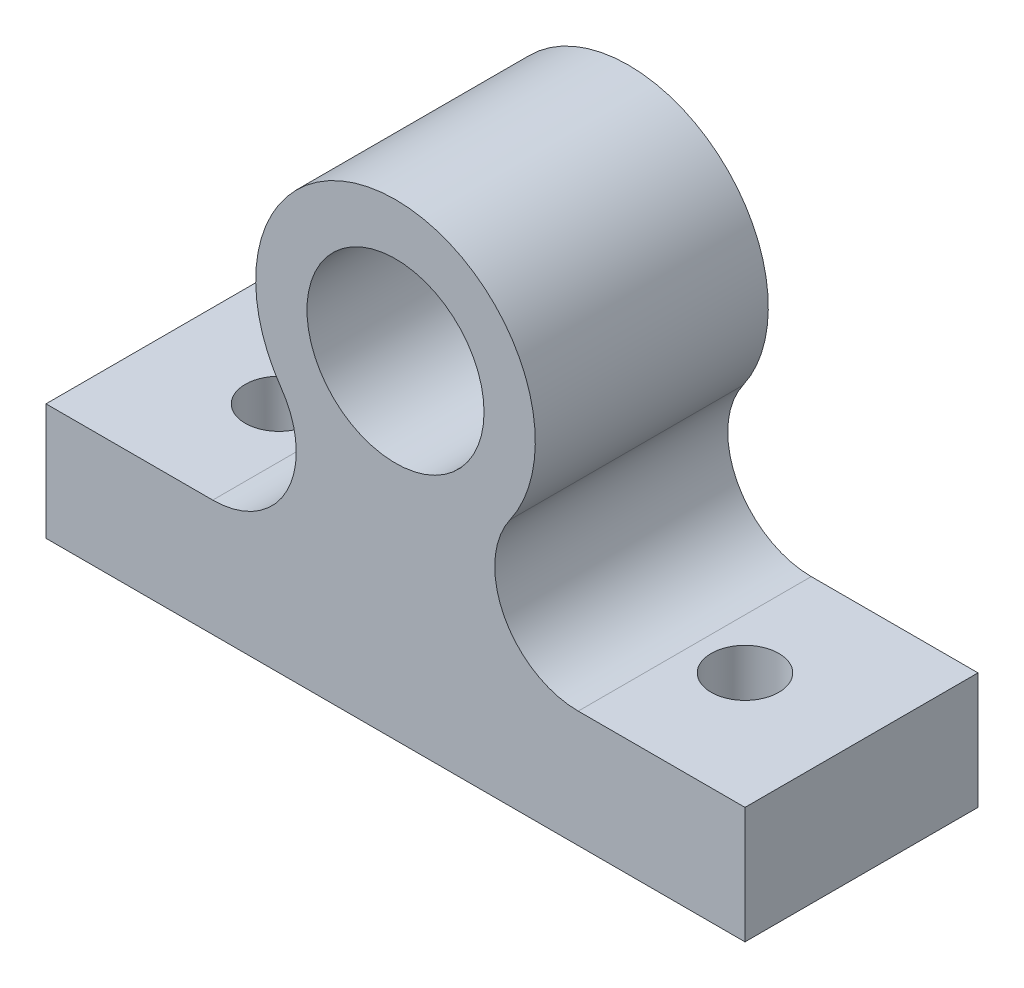
ISO-10303-21;
HEADER;
FILE_DESCRIPTION(('STEP AP214'),'2;1');
FILE_NAME('part.step','',(''),(''),'','','');
FILE_SCHEMA(('AUTOMOTIVE_DESIGN { 1 0 10303 214 1 1 1 1 }'));
ENDSEC;
DATA;
#1=APPLICATION_CONTEXT('core data for automotive mechanical design processes');
#2=APPLICATION_PROTOCOL_DEFINITION('international standard','automotive_design',2000,#1);
#3=PRODUCT_CONTEXT('',#1,'mechanical');
#4=PRODUCT('Part','Part','',(#3));
#5=PRODUCT_RELATED_PRODUCT_CATEGORY('part','',(#4));
#6=PRODUCT_DEFINITION_FORMATION('','',#4);
#7=PRODUCT_DEFINITION_CONTEXT('part definition',#1,'design');
#8=PRODUCT_DEFINITION('design','',#6,#7);
#9=PRODUCT_DEFINITION_SHAPE('','',#8);
#10=(LENGTH_UNIT() NAMED_UNIT(*) SI_UNIT(.MILLI.,.METRE.));
#11=(NAMED_UNIT(*) PLANE_ANGLE_UNIT() SI_UNIT($,.RADIAN.));
#12=(NAMED_UNIT(*) SI_UNIT($,.STERADIAN.) SOLID_ANGLE_UNIT());
#13=UNCERTAINTY_MEASURE_WITH_UNIT(LENGTH_MEASURE(1.E-05),#10,'distance_accuracy_value','');
#14=(GEOMETRIC_REPRESENTATION_CONTEXT(3) GLOBAL_UNCERTAINTY_ASSIGNED_CONTEXT((#13)) GLOBAL_UNIT_ASSIGNED_CONTEXT((#10,
#11,#12)) REPRESENTATION_CONTEXT('',''));
#15=CARTESIAN_POINT('',(0.,0.,0.));
#16=DIRECTION('',(0.,0.,1.));
#17=DIRECTION('',(1.,0.,0.));
#18=AXIS2_PLACEMENT_3D('',#15,#16,#17);
#19=CARTESIAN_POINT('',(9.08916554618517,10.9012996441002,12.7));
#20=DIRECTION('',(0.,0.,1.));
#21=DIRECTION('',(1.,0.,0.));
#22=AXIS2_PLACEMENT_3D('',#19,#20,#21);
#23=PLANE('',#22);
#24=DIRECTION('',(0.,-1.,0.));
#25=VECTOR('',#24,1.);
#26=CARTESIAN_POINT('',(0.,0.,12.7));
#27=LINE('',#26,#25);
#28=CARTESIAN_POINT('',(0.,6.35,12.7));
#29=VERTEX_POINT('',#28);
#30=CARTESIAN_POINT('',(0.,0.,12.7));
#31=VERTEX_POINT('',#30);
#32=EDGE_CURVE('E170',#29,#31,#27,.T.);
#33=ORIENTED_EDGE('',*,*,#32,.T.);
#34=DIRECTION('',(1.,0.,0.));
#35=VECTOR('',#34,1.);
#36=CARTESIAN_POINT('',(0.,0.,12.7));
#37=LINE('',#36,#35);
#38=CARTESIAN_POINT('',(38.1,0.,12.7));
#39=VERTEX_POINT('',#38);
#40=EDGE_CURVE('E106',#31,#39,#37,.T.);
#41=ORIENTED_EDGE('',*,*,#40,.T.);
#42=DIRECTION('',(0.,1.,0.));
#43=VECTOR('',#42,1.);
#44=CARTESIAN_POINT('',(38.1,0.,12.7));
#45=LINE('',#44,#43);
#46=CARTESIAN_POINT('',(38.1,6.35,12.7));
#47=VERTEX_POINT('',#46);
#48=EDGE_CURVE('E216',#39,#47,#45,.T.);
#49=ORIENTED_EDGE('',*,*,#48,.T.);
#50=DIRECTION('',(-1.,0.,0.));
#51=VECTOR('',#50,1.);
#52=CARTESIAN_POINT('',(38.1,6.35,12.7));
#53=LINE('',#52,#51);
#54=CARTESIAN_POINT('',(29.0108344538148,6.35,12.7));
#55=VERTEX_POINT('',#54);
#56=EDGE_CURVE('E219',#47,#55,#53,.T.);
#57=ORIENTED_EDGE('',*,*,#56,.T.);
#58=CARTESIAN_POINT('',(29.0108344538148,10.9012996441002,12.7));
#59=DIRECTION('',(0.,0.,-1.));
#60=DIRECTION('',(-1.,0.,0.));
#61=AXIS2_PLACEMENT_3D('',#58,#59,#60);
#62=CIRCLE('',#61,4.55129964410019);
#63=CARTESIAN_POINT('',(25.2861095986048,13.5167830035134,12.7));
#64=VERTEX_POINT('',#63);
#65=EDGE_CURVE('E125',#55,#64,#62,.T.);
#66=ORIENTED_EDGE('',*,*,#65,.T.);
#67=CARTESIAN_POINT('',(19.05,17.8957483007256,12.7));
#68=DIRECTION('',(0.,0.,1.));
#69=DIRECTION('',(1.,0.,0.));
#70=AXIS2_PLACEMENT_3D('',#67,#68,#69);
#71=CIRCLE('',#70,7.62);
#72=CARTESIAN_POINT('',(12.8138904013952,13.5167830035134,12.7));
#73=VERTEX_POINT('',#72);
#74=EDGE_CURVE('E119',#64,#73,#71,.T.);
#75=ORIENTED_EDGE('',*,*,#74,.T.);
#76=CARTESIAN_POINT('',(9.08916554618517,10.9012996441002,12.7));
#77=DIRECTION('',(0.,0.,-1.));
#78=DIRECTION('',(1.,0.,0.));
#79=AXIS2_PLACEMENT_3D('',#76,#77,#78);
#80=CIRCLE('',#79,4.5512996441002);
#81=CARTESIAN_POINT('',(9.08916554618517,6.35,12.7));
#82=VERTEX_POINT('',#81);
#83=EDGE_CURVE('E123',#73,#82,#80,.T.);
#84=ORIENTED_EDGE('',*,*,#83,.T.);
#85=DIRECTION('',(-1.,0.,0.));
#86=VECTOR('',#85,1.);
#87=CARTESIAN_POINT('',(0.,6.35,12.7));
#88=LINE('',#87,#86);
#89=EDGE_CURVE('E63',#82,#29,#88,.T.);
#90=ORIENTED_EDGE('',*,*,#89,.T.);
#91=EDGE_LOOP('',(#33,#41,#49,#57,#66,#75,#84,#90));
#92=FACE_BOUND('',#91,.T.);
#93=CARTESIAN_POINT('',(19.05,17.8957483007256,12.7));
#94=DIRECTION('',(0.,0.,1.));
#95=DIRECTION('',(1.,0.,0.));
#96=AXIS2_PLACEMENT_3D('',#93,#94,#95);
#97=CIRCLE('',#96,4.826);
#98=CARTESIAN_POINT('',(23.876,17.8957483007256,12.7));
#99=VERTEX_POINT('',#98);
#100=EDGE_CURVE('E152',#99,#99,#97,.T.);
#101=ORIENTED_EDGE('',*,*,#100,.F.);
#102=EDGE_LOOP('',(#101));
#103=FACE_BOUND('',#102,.T.);
#104=ADVANCED_FACE('F43',(#92,#103),#23,.T.);
#105=CARTESIAN_POINT('',(9.08916554618517,10.9012996441002,0.));
#106=DIRECTION('',(0.,0.,1.));
#107=DIRECTION('',(1.,0.,0.));
#108=AXIS2_PLACEMENT_3D('',#105,#106,#107);
#109=PLANE('',#108);
#110=DIRECTION('',(0.,-1.,0.));
#111=VECTOR('',#110,1.);
#112=CARTESIAN_POINT('',(0.,0.,0.));
#113=LINE('',#112,#111);
#114=CARTESIAN_POINT('',(0.,6.35,0.));
#115=VERTEX_POINT('',#114);
#116=CARTESIAN_POINT('',(0.,0.,0.));
#117=VERTEX_POINT('',#116);
#118=EDGE_CURVE('E147',#115,#117,#113,.T.);
#119=ORIENTED_EDGE('',*,*,#118,.F.);
#120=DIRECTION('',(-1.,0.,0.));
#121=VECTOR('',#120,1.);
#122=CARTESIAN_POINT('',(0.,6.35,0.));
#123=LINE('',#122,#121);
#124=CARTESIAN_POINT('',(9.08916554618517,6.35,0.));
#125=VERTEX_POINT('',#124);
#126=EDGE_CURVE('E98',#125,#115,#123,.T.);
#127=ORIENTED_EDGE('',*,*,#126,.F.);
#128=CARTESIAN_POINT('',(9.08916554618517,10.9012996441002,0.));
#129=DIRECTION('',(0.,0.,-1.));
#130=DIRECTION('',(1.,0.,0.));
#131=AXIS2_PLACEMENT_3D('',#128,#129,#130);
#132=CIRCLE('',#131,4.5512996441002);
#133=CARTESIAN_POINT('',(12.8138904013952,13.5167830035134,0.));
#134=VERTEX_POINT('',#133);
#135=EDGE_CURVE('E92',#134,#125,#132,.T.);
#136=ORIENTED_EDGE('',*,*,#135,.F.);
#137=CARTESIAN_POINT('',(19.05,17.8957483007256,0.));
#138=DIRECTION('',(0.,0.,1.));
#139=DIRECTION('',(1.,0.,0.));
#140=AXIS2_PLACEMENT_3D('',#137,#138,#139);
#141=CIRCLE('',#140,7.62);
#142=CARTESIAN_POINT('',(25.2861095986048,13.5167830035134,0.));
#143=VERTEX_POINT('',#142);
#144=EDGE_CURVE('E134',#143,#134,#141,.T.);
#145=ORIENTED_EDGE('',*,*,#144,.F.);
#146=CARTESIAN_POINT('',(29.0108344538148,10.9012996441002,0.));
#147=DIRECTION('',(0.,0.,-1.));
#148=DIRECTION('',(-1.,0.,0.));
#149=AXIS2_PLACEMENT_3D('',#146,#147,#148);
#150=CIRCLE('',#149,4.55129964410019);
#151=CARTESIAN_POINT('',(29.0108344538148,6.35,0.));
#152=VERTEX_POINT('',#151);
#153=EDGE_CURVE('E161',#152,#143,#150,.T.);
#154=ORIENTED_EDGE('',*,*,#153,.F.);
#155=DIRECTION('',(-1.,0.,0.));
#156=VECTOR('',#155,1.);
#157=CARTESIAN_POINT('',(38.1,6.35,0.));
#158=LINE('',#157,#156);
#159=CARTESIAN_POINT('',(38.1,6.35,0.));
#160=VERTEX_POINT('',#159);
#161=EDGE_CURVE('E158',#160,#152,#158,.T.);
#162=ORIENTED_EDGE('',*,*,#161,.F.);
#163=DIRECTION('',(0.,1.,0.));
#164=VECTOR('',#163,1.);
#165=CARTESIAN_POINT('',(38.1,0.,0.));
#166=LINE('',#165,#164);
#167=CARTESIAN_POINT('',(38.1,0.,0.));
#168=VERTEX_POINT('',#167);
#169=EDGE_CURVE('E155',#168,#160,#166,.T.);
#170=ORIENTED_EDGE('',*,*,#169,.F.);
#171=DIRECTION('',(1.,0.,0.));
#172=VECTOR('',#171,1.);
#173=CARTESIAN_POINT('',(0.,0.,0.));
#174=LINE('',#173,#172);
#175=EDGE_CURVE('E151',#117,#168,#174,.T.);
#176=ORIENTED_EDGE('',*,*,#175,.F.);
#177=EDGE_LOOP('',(#119,#127,#136,#145,#154,#162,#170,#176));
#178=FACE_BOUND('',#177,.T.);
#179=CARTESIAN_POINT('',(19.05,17.8957483007256,0.));
#180=DIRECTION('',(0.,0.,1.));
#181=DIRECTION('',(1.,0.,0.));
#182=AXIS2_PLACEMENT_3D('',#179,#180,#181);
#183=CIRCLE('',#182,4.826);
#184=CARTESIAN_POINT('',(23.876,17.8957483007256,0.));
#185=VERTEX_POINT('',#184);
#186=EDGE_CURVE('E196',#185,#185,#183,.T.);
#187=ORIENTED_EDGE('',*,*,#186,.T.);
#188=EDGE_LOOP('',(#187));
#189=FACE_BOUND('',#188,.T.);
#190=ADVANCED_FACE('F234',(#178,#189),#109,.F.);
#191=CARTESIAN_POINT('',(0.,0.,12.7));
#192=DIRECTION('',(1.,0.,0.));
#193=DIRECTION('',(0.,0.,-1.));
#194=AXIS2_PLACEMENT_3D('',#191,#192,#193);
#195=PLANE('',#194);
#196=ORIENTED_EDGE('',*,*,#118,.T.);
#197=DIRECTION('',(0.,0.,-1.));
#198=VECTOR('',#197,1.);
#199=CARTESIAN_POINT('',(0.,0.,12.7));
#200=LINE('',#199,#198);
#201=EDGE_CURVE('E11',#31,#117,#200,.T.);
#202=ORIENTED_EDGE('',*,*,#201,.F.);
#203=ORIENTED_EDGE('',*,*,#32,.F.);
#204=DIRECTION('',(0.,0.,-1.));
#205=VECTOR('',#204,1.);
#206=CARTESIAN_POINT('',(0.,6.35,12.7));
#207=LINE('',#206,#205);
#208=EDGE_CURVE('E143',#29,#115,#207,.T.);
#209=ORIENTED_EDGE('',*,*,#208,.T.);
#210=EDGE_LOOP('',(#196,#202,#203,#209));
#211=FACE_BOUND('',#210,.T.);
#212=ADVANCED_FACE('F45',(#211),#195,.F.);
#213=CARTESIAN_POINT('',(0.,0.,12.7));
#214=DIRECTION('',(0.,1.,0.));
#215=DIRECTION('',(0.,0.,1.));
#216=AXIS2_PLACEMENT_3D('',#213,#214,#215);
#217=PLANE('',#216);
#218=CARTESIAN_POINT('',(6.35,0.,6.35));
#219=DIRECTION('',(0.,1.,0.));
#220=DIRECTION('',(0.,0.,1.));
#221=AXIS2_PLACEMENT_3D('',#218,#219,#220);
#222=CIRCLE('',#221,1.8415);
#223=CARTESIAN_POINT('',(6.35,0.,8.1915));
#224=VERTEX_POINT('',#223);
#225=EDGE_CURVE('E190',#224,#224,#222,.T.);
#226=ORIENTED_EDGE('',*,*,#225,.T.);
#227=EDGE_LOOP('',(#226));
#228=FACE_BOUND('',#227,.T.);
#229=CARTESIAN_POINT('',(31.75,0.,6.35));
#230=DIRECTION('',(0.,1.,0.));
#231=DIRECTION('',(0.,0.,1.));
#232=AXIS2_PLACEMENT_3D('',#229,#230,#231);
#233=CIRCLE('',#232,1.8415);
#234=CARTESIAN_POINT('',(31.75,0.,8.1915));
#235=VERTEX_POINT('',#234);
#236=EDGE_CURVE('E198',#235,#235,#233,.T.);
#237=ORIENTED_EDGE('',*,*,#236,.T.);
#238=EDGE_LOOP('',(#237));
#239=FACE_BOUND('',#238,.T.);
#240=ORIENTED_EDGE('',*,*,#175,.T.);
#241=DIRECTION('',(0.,0.,-1.));
#242=VECTOR('',#241,1.);
#243=CARTESIAN_POINT('',(38.1,0.,12.7));
#244=LINE('',#243,#242);
#245=EDGE_CURVE('E54',#39,#168,#244,.T.);
#246=ORIENTED_EDGE('',*,*,#245,.F.);
#247=ORIENTED_EDGE('',*,*,#40,.F.);
#248=ORIENTED_EDGE('',*,*,#201,.T.);
#249=EDGE_LOOP('',(#240,#246,#247,#248));
#250=FACE_BOUND('',#249,.T.);
#251=ADVANCED_FACE('F340',(#228,#239,#250),#217,.F.);
#252=CARTESIAN_POINT('',(38.1,0.,12.7));
#253=DIRECTION('',(-1.,0.,0.));
#254=DIRECTION('',(0.,0.,1.));
#255=AXIS2_PLACEMENT_3D('',#252,#253,#254);
#256=PLANE('',#255);
#257=ORIENTED_EDGE('',*,*,#169,.T.);
#258=DIRECTION('',(0.,0.,-1.));
#259=VECTOR('',#258,1.);
#260=CARTESIAN_POINT('',(38.1,6.35,12.7));
#261=LINE('',#260,#259);
#262=EDGE_CURVE('E181',#47,#160,#261,.T.);
#263=ORIENTED_EDGE('',*,*,#262,.F.);
#264=ORIENTED_EDGE('',*,*,#48,.F.);
#265=ORIENTED_EDGE('',*,*,#245,.T.);
#266=EDGE_LOOP('',(#257,#263,#264,#265));
#267=FACE_BOUND('',#266,.T.);
#268=ADVANCED_FACE('F330',(#267),#256,.F.);
#269=CARTESIAN_POINT('',(38.1,6.35,12.7));
#270=DIRECTION('',(0.,-1.,0.));
#271=DIRECTION('',(1.,0.,0.));
#272=AXIS2_PLACEMENT_3D('',#269,#270,#271);
#273=PLANE('',#272);
#274=CARTESIAN_POINT('',(31.75,6.35,6.35));
#275=DIRECTION('',(0.,-1.,0.));
#276=DIRECTION('',(1.,0.,0.));
#277=AXIS2_PLACEMENT_3D('',#274,#275,#276);
#278=CIRCLE('',#277,1.8415);
#279=CARTESIAN_POINT('',(33.5915,6.35,6.35));
#280=VERTEX_POINT('',#279);
#281=EDGE_CURVE('E47',#280,#280,#278,.T.);
#282=ORIENTED_EDGE('',*,*,#281,.T.);
#283=EDGE_LOOP('',(#282));
#284=FACE_BOUND('',#283,.T.);
#285=ORIENTED_EDGE('',*,*,#161,.T.);
#286=DIRECTION('',(0.,0.,-1.));
#287=VECTOR('',#286,1.);
#288=CARTESIAN_POINT('',(29.0108344538148,6.35,12.7));
#289=LINE('',#288,#287);
#290=EDGE_CURVE('E177',#55,#152,#289,.T.);
#291=ORIENTED_EDGE('',*,*,#290,.F.);
#292=ORIENTED_EDGE('',*,*,#56,.F.);
#293=ORIENTED_EDGE('',*,*,#262,.T.);
#294=EDGE_LOOP('',(#285,#291,#292,#293));
#295=FACE_BOUND('',#294,.T.);
#296=ADVANCED_FACE('F227',(#284,#295),#273,.F.);
#297=CARTESIAN_POINT('',(29.0108344538148,10.9012996441002,12.7));
#298=DIRECTION('',(0.,0.,-1.));
#299=DIRECTION('',(-1.,0.,0.));
#300=AXIS2_PLACEMENT_3D('',#297,#298,#299);
#301=CYLINDRICAL_SURFACE('',#300,4.55129964410019);
#302=ORIENTED_EDGE('',*,*,#153,.T.);
#303=DIRECTION('',(0.,0.,-1.));
#304=VECTOR('',#303,1.);
#305=CARTESIAN_POINT('',(25.2861095986048,13.5167830035134,12.7));
#306=LINE('',#305,#304);
#307=EDGE_CURVE('E136',#64,#143,#306,.T.);
#308=ORIENTED_EDGE('',*,*,#307,.F.);
#309=ORIENTED_EDGE('',*,*,#65,.F.);
#310=ORIENTED_EDGE('',*,*,#290,.T.);
#311=EDGE_LOOP('',(#302,#308,#309,#310));
#312=FACE_BOUND('',#311,.T.);
#313=ADVANCED_FACE('F231',(#312),#301,.F.);
#314=CARTESIAN_POINT('',(19.05,17.8957483007256,12.7));
#315=DIRECTION('',(0.,0.,-1.));
#316=DIRECTION('',(-1.,0.,0.));
#317=AXIS2_PLACEMENT_3D('',#314,#315,#316);
#318=CYLINDRICAL_SURFACE('',#317,7.62);
#319=ORIENTED_EDGE('',*,*,#144,.T.);
#320=DIRECTION('',(0.,0.,-1.));
#321=VECTOR('',#320,1.);
#322=CARTESIAN_POINT('',(12.8138904013952,13.5167830035134,12.7));
#323=LINE('',#322,#321);
#324=EDGE_CURVE('E131',#73,#134,#323,.T.);
#325=ORIENTED_EDGE('',*,*,#324,.F.);
#326=ORIENTED_EDGE('',*,*,#74,.F.);
#327=ORIENTED_EDGE('',*,*,#307,.T.);
#328=EDGE_LOOP('',(#319,#325,#326,#327));
#329=FACE_BOUND('',#328,.T.);
#330=ADVANCED_FACE('F132',(#329),#318,.T.);
#331=CARTESIAN_POINT('',(9.08916554618517,10.9012996441002,12.7));
#332=DIRECTION('',(0.,0.,-1.));
#333=DIRECTION('',(-1.,0.,0.));
#334=AXIS2_PLACEMENT_3D('',#331,#332,#333);
#335=CYLINDRICAL_SURFACE('',#334,4.5512996441002);
#336=ORIENTED_EDGE('',*,*,#135,.T.);
#337=DIRECTION('',(0.,0.,-1.));
#338=VECTOR('',#337,1.);
#339=CARTESIAN_POINT('',(9.08916554618517,6.35,12.7));
#340=LINE('',#339,#338);
#341=EDGE_CURVE('E137',#82,#125,#340,.T.);
#342=ORIENTED_EDGE('',*,*,#341,.F.);
#343=ORIENTED_EDGE('',*,*,#83,.F.);
#344=ORIENTED_EDGE('',*,*,#324,.T.);
#345=EDGE_LOOP('',(#336,#342,#343,#344));
#346=FACE_BOUND('',#345,.T.);
#347=ADVANCED_FACE('F139',(#346),#335,.F.);
#348=CARTESIAN_POINT('',(0.,6.35,12.7));
#349=DIRECTION('',(0.,-1.,0.));
#350=DIRECTION('',(0.,0.,-1.));
#351=AXIS2_PLACEMENT_3D('',#348,#349,#350);
#352=PLANE('',#351);
#353=CARTESIAN_POINT('',(6.35,6.35,6.35));
#354=DIRECTION('',(0.,-1.,0.));
#355=DIRECTION('',(0.,0.,-1.));
#356=AXIS2_PLACEMENT_3D('',#353,#354,#355);
#357=CIRCLE('',#356,1.8415);
#358=CARTESIAN_POINT('',(6.35,6.35,4.5085));
#359=VERTEX_POINT('',#358);
#360=EDGE_CURVE('E187',#359,#359,#357,.T.);
#361=ORIENTED_EDGE('',*,*,#360,.T.);
#362=EDGE_LOOP('',(#361));
#363=FACE_BOUND('',#362,.T.);
#364=ORIENTED_EDGE('',*,*,#126,.T.);
#365=ORIENTED_EDGE('',*,*,#208,.F.);
#366=ORIENTED_EDGE('',*,*,#89,.F.);
#367=ORIENTED_EDGE('',*,*,#341,.T.);
#368=EDGE_LOOP('',(#364,#365,#366,#367));
#369=FACE_BOUND('',#368,.T.);
#370=ADVANCED_FACE('F240',(#363,#369),#352,.F.);
#371=CARTESIAN_POINT('',(19.05,17.8957483007256,12.7));
#372=DIRECTION('',(0.,0.,-1.));
#373=DIRECTION('',(-1.,0.,0.));
#374=AXIS2_PLACEMENT_3D('',#371,#372,#373);
#375=CYLINDRICAL_SURFACE('',#374,4.826);
#376=ORIENTED_EDGE('',*,*,#100,.T.);
#377=EDGE_LOOP('',(#376));
#378=FACE_BOUND('',#377,.T.);
#379=ORIENTED_EDGE('',*,*,#186,.F.);
#380=EDGE_LOOP('',(#379));
#381=FACE_BOUND('',#380,.T.);
#382=ADVANCED_FACE('F242',(#378,#381),#375,.F.);
#383=CARTESIAN_POINT('',(6.35,0.,6.35));
#384=DIRECTION('',(0.,1.,0.));
#385=DIRECTION('',(0.,0.,1.));
#386=AXIS2_PLACEMENT_3D('',#383,#384,#385);
#387=CYLINDRICAL_SURFACE('',#386,1.8415);
#388=ORIENTED_EDGE('',*,*,#225,.F.);
#389=EDGE_LOOP('',(#388));
#390=FACE_BOUND('',#389,.T.);
#391=ORIENTED_EDGE('',*,*,#360,.F.);
#392=EDGE_LOOP('',(#391));
#393=FACE_BOUND('',#392,.T.);
#394=ADVANCED_FACE('F248',(#390,#393),#387,.F.);
#395=CARTESIAN_POINT('',(31.75,0.,6.35));
#396=DIRECTION('',(0.,1.,0.));
#397=DIRECTION('',(0.,0.,1.));
#398=AXIS2_PLACEMENT_3D('',#395,#396,#397);
#399=CYLINDRICAL_SURFACE('',#398,1.8415);
#400=ORIENTED_EDGE('',*,*,#236,.F.);
#401=EDGE_LOOP('',(#400));
#402=FACE_BOUND('',#401,.T.);
#403=ORIENTED_EDGE('',*,*,#281,.F.);
#404=EDGE_LOOP('',(#403));
#405=FACE_BOUND('',#404,.T.);
#406=ADVANCED_FACE('F259',(#402,#405),#399,.F.);
#407=CLOSED_SHELL('',(#104,#190,#212,#251,#268,#296,#313,#330,#347,#370,#382,#394,#406));
#408=MANIFOLD_SOLID_BREP('B2',#407);
#409=ADVANCED_BREP_SHAPE_REPRESENTATION('',(#18,#408),#14);
#410=SHAPE_DEFINITION_REPRESENTATION(#9,#409);
ENDSEC;
END-ISO-10303-21;
